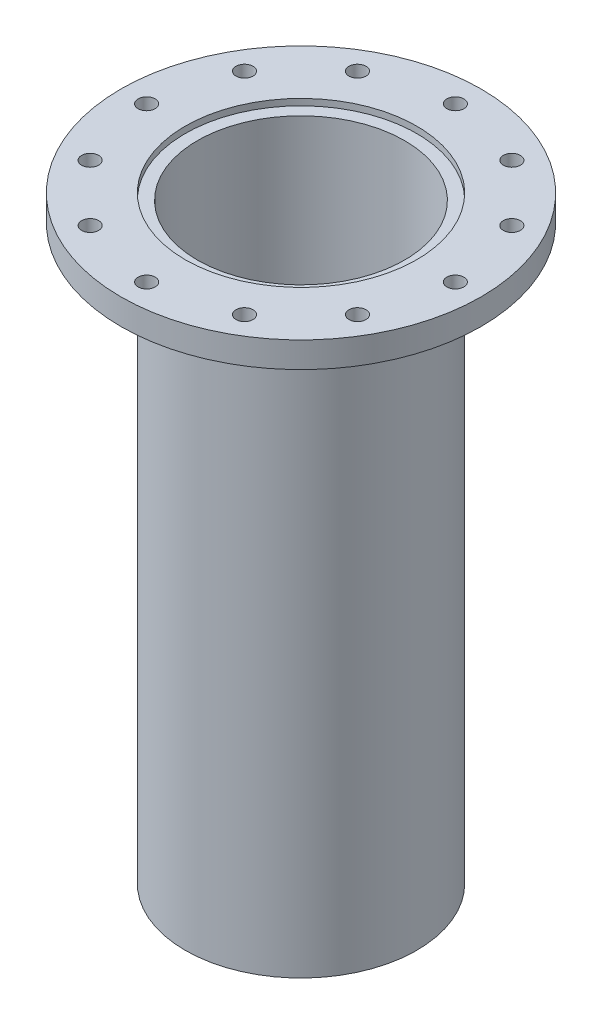
ISO-10303-21;
HEADER;
FILE_DESCRIPTION(('STEP AP214'),'2;1');
FILE_NAME('part.step','',(''),(''),'','','');
FILE_SCHEMA(('AUTOMOTIVE_DESIGN { 1 0 10303 214 1 1 1 1 }'));
ENDSEC;
DATA;
#1=APPLICATION_CONTEXT('core data for automotive mechanical design processes');
#2=APPLICATION_PROTOCOL_DEFINITION('international standard','automotive_design',2000,#1);
#3=PRODUCT_CONTEXT('',#1,'mechanical');
#4=PRODUCT('Part','Part','',(#3));
#5=PRODUCT_RELATED_PRODUCT_CATEGORY('part','',(#4));
#6=PRODUCT_DEFINITION_FORMATION('','',#4);
#7=PRODUCT_DEFINITION_CONTEXT('part definition',#1,'design');
#8=PRODUCT_DEFINITION('design','',#6,#7);
#9=PRODUCT_DEFINITION_SHAPE('','',#8);
#10=(LENGTH_UNIT() NAMED_UNIT(*) SI_UNIT(.MILLI.,.METRE.));
#11=(NAMED_UNIT(*) PLANE_ANGLE_UNIT() SI_UNIT($,.RADIAN.));
#12=(NAMED_UNIT(*) SI_UNIT($,.STERADIAN.) SOLID_ANGLE_UNIT());
#13=UNCERTAINTY_MEASURE_WITH_UNIT(LENGTH_MEASURE(1.E-05),#10,'distance_accuracy_value','');
#14=(GEOMETRIC_REPRESENTATION_CONTEXT(3) GLOBAL_UNCERTAINTY_ASSIGNED_CONTEXT((#13)) GLOBAL_UNIT_ASSIGNED_CONTEXT((#10,
#11,#12)) REPRESENTATION_CONTEXT('',''));
#15=CARTESIAN_POINT('',(0.,0.,0.));
#16=DIRECTION('',(0.,0.,1.));
#17=DIRECTION('',(1.,0.,0.));
#18=AXIS2_PLACEMENT_3D('',#15,#16,#17);
#19=CARTESIAN_POINT('',(0.,0.,0.));
#20=DIRECTION('',(0.,1.,0.));
#21=DIRECTION('',(0.,0.,1.));
#22=AXIS2_PLACEMENT_3D('',#19,#20,#21);
#23=CYLINDRICAL_SURFACE('',#22,57.15);
#24=CARTESIAN_POINT('',(0.,0.,0.));
#25=DIRECTION('',(0.,1.,0.));
#26=DIRECTION('',(0.,0.,1.));
#27=AXIS2_PLACEMENT_3D('',#24,#25,#26);
#28=CIRCLE('',#27,57.15);
#29=CARTESIAN_POINT('',(0.,0.,57.15));
#30=VERTEX_POINT('',#29);
#31=EDGE_CURVE('E10',#30,#30,#28,.T.);
#32=ORIENTED_EDGE('',*,*,#31,.T.);
#33=EDGE_LOOP('',(#32));
#34=FACE_BOUND('',#33,.T.);
#35=CARTESIAN_POINT('',(0.,-3.175,0.));
#36=DIRECTION('',(0.,1.,0.));
#37=DIRECTION('',(0.,0.,1.));
#38=AXIS2_PLACEMENT_3D('',#35,#36,#37);
#39=CIRCLE('',#38,57.15);
#40=CARTESIAN_POINT('',(0.,-3.175,57.15));
#41=VERTEX_POINT('',#40);
#42=EDGE_CURVE('E72',#41,#41,#39,.T.);
#43=ORIENTED_EDGE('',*,*,#42,.F.);
#44=EDGE_LOOP('',(#43));
#45=FACE_BOUND('',#44,.T.);
#46=ADVANCED_FACE('F37',(#34,#45),#23,.F.);
#47=CARTESIAN_POINT('',(-57.15,0.,0.));
#48=DIRECTION('',(0.,1.,0.));
#49=DIRECTION('',(0.,0.,1.));
#50=AXIS2_PLACEMENT_3D('',#47,#48,#49);
#51=PLANE('',#50);
#52=CARTESIAN_POINT('',(-38.0999999999999,0.,-65.9911357683743));
#53=DIRECTION('',(0.,1.,0.));
#54=DIRECTION('',(-0.86602540378444,0.,0.499999999999998));
#55=AXIS2_PLACEMENT_3D('',#52,#53,#54);
#56=CIRCLE('',#55,4.21639999999999);
#57=CARTESIAN_POINT('',(-41.7515095125166,0.,-63.8829357683743));
#58=VERTEX_POINT('',#57);
#59=EDGE_CURVE('E92',#58,#58,#56,.T.);
#60=ORIENTED_EDGE('',*,*,#59,.F.);
#61=EDGE_LOOP('',(#60));
#62=FACE_BOUND('',#61,.T.);
#63=CARTESIAN_POINT('',(2.66050878019847E-13,0.,-76.2));
#64=DIRECTION('',(0.,1.,0.));
#65=DIRECTION('',(-1.,0.,0.));
#66=AXIS2_PLACEMENT_3D('',#63,#64,#65);
#67=CIRCLE('',#66,4.21639999999999);
#68=CARTESIAN_POINT('',(-4.21639999999973,0.,-76.2));
#69=VERTEX_POINT('',#68);
#70=EDGE_CURVE('E143',#69,#69,#67,.T.);
#71=ORIENTED_EDGE('',*,*,#70,.F.);
#72=EDGE_LOOP('',(#71));
#73=FACE_BOUND('',#72,.T.);
#74=CARTESIAN_POINT('',(38.1000000000003,0.,-65.9911357683741));
#75=DIRECTION('',(0.,1.,0.));
#76=DIRECTION('',(-0.866025403784436,0.,-0.500000000000004));
#77=AXIS2_PLACEMENT_3D('',#74,#75,#76);
#78=CIRCLE('',#77,4.21639999999999);
#79=CARTESIAN_POINT('',(34.4484904874836,0.,-68.0993357683741));
#80=VERTEX_POINT('',#79);
#81=EDGE_CURVE('E135',#80,#80,#78,.T.);
#82=ORIENTED_EDGE('',*,*,#81,.F.);
#83=EDGE_LOOP('',(#82));
#84=FACE_BOUND('',#83,.T.);
#85=CARTESIAN_POINT('',(65.9911357683744,0.,-38.0999999999996));
#86=DIRECTION('',(0.,1.,0.));
#87=DIRECTION('',(-0.499999999999995,0.,-0.866025403784442));
#88=AXIS2_PLACEMENT_3D('',#85,#86,#87);
#89=CIRCLE('',#88,4.21639999999999);
#90=CARTESIAN_POINT('',(63.8829357683745,0.,-41.7515095125163));
#91=VERTEX_POINT('',#90);
#92=EDGE_CURVE('E127',#91,#91,#89,.T.);
#93=ORIENTED_EDGE('',*,*,#92,.F.);
#94=EDGE_LOOP('',(#93));
#95=FACE_BOUND('',#94,.T.);
#96=CARTESIAN_POINT('',(76.2,0.,0.));
#97=DIRECTION('',(0.,1.,0.));
#98=DIRECTION('',(0.,0.,-1.));
#99=AXIS2_PLACEMENT_3D('',#96,#97,#98);
#100=CIRCLE('',#99,4.21639999999999);
#101=CARTESIAN_POINT('',(76.2,0.,-4.21639999999999));
#102=VERTEX_POINT('',#101);
#103=EDGE_CURVE('E119',#102,#102,#100,.T.);
#104=ORIENTED_EDGE('',*,*,#103,.F.);
#105=EDGE_LOOP('',(#104));
#106=FACE_BOUND('',#105,.T.);
#107=CARTESIAN_POINT('',(65.9911357683739,0.,38.1000000000005));
#108=DIRECTION('',(0.,1.,0.));
#109=DIRECTION('',(0.500000000000007,0.,-0.866025403784435));
#110=AXIS2_PLACEMENT_3D('',#107,#108,#109);
#111=CIRCLE('',#110,4.21639999999999);
#112=CARTESIAN_POINT('',(68.099335768374,0.,34.4484904874839));
#113=VERTEX_POINT('',#112);
#114=EDGE_CURVE('E111',#113,#113,#111,.T.);
#115=ORIENTED_EDGE('',*,*,#114,.F.);
#116=EDGE_LOOP('',(#115));
#117=FACE_BOUND('',#116,.T.);
#118=CARTESIAN_POINT('',(38.0999999999994,0.,65.9911357683746));
#119=DIRECTION('',(0.,1.,0.));
#120=DIRECTION('',(0.866025403784443,0.,-0.499999999999992));
#121=AXIS2_PLACEMENT_3D('',#118,#119,#120);
#122=CIRCLE('',#121,4.21639999999999);
#123=CARTESIAN_POINT('',(41.7515095125161,0.,63.8829357683746));
#124=VERTEX_POINT('',#123);
#125=EDGE_CURVE('E103',#124,#124,#122,.T.);
#126=ORIENTED_EDGE('',*,*,#125,.F.);
#127=EDGE_LOOP('',(#126));
#128=FACE_BOUND('',#127,.T.);
#129=CARTESIAN_POINT('',(-7.9815263405954E-13,0.,76.2));
#130=DIRECTION('',(0.,1.,0.));
#131=DIRECTION('',(1.,0.,0.));
#132=AXIS2_PLACEMENT_3D('',#129,#130,#131);
#133=CIRCLE('',#132,4.21639999999999);
#134=CARTESIAN_POINT('',(4.2163999999992,0.,76.2));
#135=VERTEX_POINT('',#134);
#136=EDGE_CURVE('E93',#135,#135,#133,.T.);
#137=ORIENTED_EDGE('',*,*,#136,.F.);
#138=EDGE_LOOP('',(#137));
#139=FACE_BOUND('',#138,.T.);
#140=CARTESIAN_POINT('',(-38.1000000000008,0.,65.9911357683738));
#141=DIRECTION('',(0.,1.,0.));
#142=DIRECTION('',(0.866025403784433,0.,0.50000000000001));
#143=AXIS2_PLACEMENT_3D('',#140,#141,#142);
#144=CIRCLE('',#143,4.21639999999999);
#145=CARTESIAN_POINT('',(-34.4484904874841,0.,68.0993357683738));
#146=VERTEX_POINT('',#145);
#147=EDGE_CURVE('E102',#146,#146,#144,.T.);
#148=ORIENTED_EDGE('',*,*,#147,.F.);
#149=EDGE_LOOP('',(#148));
#150=FACE_BOUND('',#149,.T.);
#151=CARTESIAN_POINT('',(-65.9911357683747,0.,38.0999999999992));
#152=DIRECTION('',(0.,1.,0.));
#153=DIRECTION('',(0.499999999999989,0.,0.866025403784445));
#154=AXIS2_PLACEMENT_3D('',#151,#152,#153);
#155=CIRCLE('',#154,4.21639999999999);
#156=CARTESIAN_POINT('',(-63.8829357683748,0.,41.7515095125159));
#157=VERTEX_POINT('',#156);
#158=EDGE_CURVE('E157',#157,#157,#155,.T.);
#159=ORIENTED_EDGE('',*,*,#158,.F.);
#160=EDGE_LOOP('',(#159));
#161=FACE_BOUND('',#160,.T.);
#162=CARTESIAN_POINT('',(-65.9911357683742,0.,-38.1000000000001));
#163=DIRECTION('',(0.,1.,0.));
#164=DIRECTION('',(-0.500000000000001,0.,0.866025403784438));
#165=AXIS2_PLACEMENT_3D('',#162,#163,#164);
#166=CIRCLE('',#165,4.21639999999999);
#167=CARTESIAN_POINT('',(-68.0993357683742,0.,-34.4484904874834));
#168=VERTEX_POINT('',#167);
#169=EDGE_CURVE('E84',#168,#168,#166,.T.);
#170=ORIENTED_EDGE('',*,*,#169,.F.);
#171=EDGE_LOOP('',(#170));
#172=FACE_BOUND('',#171,.T.);
#173=CARTESIAN_POINT('',(-76.2,0.,0.));
#174=DIRECTION('',(0.,1.,0.));
#175=DIRECTION('',(0.,0.,1.));
#176=AXIS2_PLACEMENT_3D('',#173,#174,#175);
#177=CIRCLE('',#176,4.21639999999999);
#178=CARTESIAN_POINT('',(-76.2,0.,4.21639999999999));
#179=VERTEX_POINT('',#178);
#180=EDGE_CURVE('E80',#179,#179,#177,.T.);
#181=ORIENTED_EDGE('',*,*,#180,.F.);
#182=EDGE_LOOP('',(#181));
#183=FACE_BOUND('',#182,.T.);
#184=CARTESIAN_POINT('',(0.,0.,0.));
#185=DIRECTION('',(0.,1.,0.));
#186=DIRECTION('',(0.,0.,1.));
#187=AXIS2_PLACEMENT_3D('',#184,#185,#186);
#188=CIRCLE('',#187,88.9);
#189=CARTESIAN_POINT('',(0.,0.,88.9));
#190=VERTEX_POINT('',#189);
#191=EDGE_CURVE('E44',#190,#190,#188,.T.);
#192=ORIENTED_EDGE('',*,*,#191,.T.);
#193=EDGE_LOOP('',(#192));
#194=FACE_BOUND('',#193,.T.);
#195=ORIENTED_EDGE('',*,*,#31,.F.);
#196=EDGE_LOOP('',(#195));
#197=FACE_BOUND('',#196,.T.);
#198=ADVANCED_FACE('F195',(#62,#73,#84,#95,#106,#117,#128,#139,#150,#161,#172,#183,#194,#197),
#51,.T.);
#199=CARTESIAN_POINT('',(0.,0.,0.));
#200=DIRECTION('',(0.,1.,0.));
#201=DIRECTION('',(0.,0.,1.));
#202=AXIS2_PLACEMENT_3D('',#199,#200,#201);
#203=CYLINDRICAL_SURFACE('',#202,88.9);
#204=CARTESIAN_POINT('',(0.,-12.7,0.));
#205=DIRECTION('',(0.,1.,0.));
#206=DIRECTION('',(0.,0.,1.));
#207=AXIS2_PLACEMENT_3D('',#204,#205,#206);
#208=CIRCLE('',#207,88.9);
#209=CARTESIAN_POINT('',(0.,-12.7,88.9));
#210=VERTEX_POINT('',#209);
#211=EDGE_CURVE('E49',#210,#210,#208,.T.);
#212=ORIENTED_EDGE('',*,*,#211,.T.);
#213=EDGE_LOOP('',(#212));
#214=FACE_BOUND('',#213,.T.);
#215=ORIENTED_EDGE('',*,*,#191,.F.);
#216=EDGE_LOOP('',(#215));
#217=FACE_BOUND('',#216,.T.);
#218=ADVANCED_FACE('F180',(#214,#217),#203,.T.);
#219=CARTESIAN_POINT('',(-88.9,-12.7,0.));
#220=DIRECTION('',(0.,-1.,0.));
#221=DIRECTION('',(0.,0.,-1.));
#222=AXIS2_PLACEMENT_3D('',#219,#220,#221);
#223=PLANE('',#222);
#224=CARTESIAN_POINT('',(-38.0999999999999,-12.7,-65.9911357683743));
#225=DIRECTION('',(0.,-1.,0.));
#226=DIRECTION('',(0.86602540378444,0.,-0.499999999999998));
#227=AXIS2_PLACEMENT_3D('',#224,#225,#226);
#228=CIRCLE('',#227,4.21639999999996);
#229=CARTESIAN_POINT('',(-34.4484904874832,-12.7,-68.0993357683743));
#230=VERTEX_POINT('',#229);
#231=EDGE_CURVE('E147',#230,#230,#228,.T.);
#232=ORIENTED_EDGE('',*,*,#231,.F.);
#233=EDGE_LOOP('',(#232));
#234=FACE_BOUND('',#233,.T.);
#235=CARTESIAN_POINT('',(2.66050878019847E-13,-12.7,-76.2));
#236=DIRECTION('',(0.,-1.,0.));
#237=DIRECTION('',(1.,0.,0.));
#238=AXIS2_PLACEMENT_3D('',#235,#236,#237);
#239=CIRCLE('',#238,4.21639999999996);
#240=CARTESIAN_POINT('',(4.21640000000023,-12.7,-76.2));
#241=VERTEX_POINT('',#240);
#242=EDGE_CURVE('E139',#241,#241,#239,.T.);
#243=ORIENTED_EDGE('',*,*,#242,.F.);
#244=EDGE_LOOP('',(#243));
#245=FACE_BOUND('',#244,.T.);
#246=CARTESIAN_POINT('',(38.1000000000003,-12.7,-65.9911357683741));
#247=DIRECTION('',(0.,-1.,0.));
#248=DIRECTION('',(0.866025403784436,0.,0.500000000000004));
#249=AXIS2_PLACEMENT_3D('',#246,#247,#248);
#250=CIRCLE('',#249,4.21639999999996);
#251=CARTESIAN_POINT('',(41.751509512517,-12.7,-63.8829357683741));
#252=VERTEX_POINT('',#251);
#253=EDGE_CURVE('E131',#252,#252,#250,.T.);
#254=ORIENTED_EDGE('',*,*,#253,.F.);
#255=EDGE_LOOP('',(#254));
#256=FACE_BOUND('',#255,.T.);
#257=CARTESIAN_POINT('',(65.9911357683744,-12.7,-38.0999999999996));
#258=DIRECTION('',(0.,-1.,0.));
#259=DIRECTION('',(0.499999999999995,0.,0.866025403784442));
#260=AXIS2_PLACEMENT_3D('',#257,#258,#259);
#261=CIRCLE('',#260,4.21639999999996);
#262=CARTESIAN_POINT('',(68.0993357683744,-12.7,-34.4484904874829));
#263=VERTEX_POINT('',#262);
#264=EDGE_CURVE('E123',#263,#263,#261,.T.);
#265=ORIENTED_EDGE('',*,*,#264,.F.);
#266=EDGE_LOOP('',(#265));
#267=FACE_BOUND('',#266,.T.);
#268=CARTESIAN_POINT('',(76.2,-12.7,0.));
#269=DIRECTION('',(0.,-1.,0.));
#270=DIRECTION('',(0.,0.,1.));
#271=AXIS2_PLACEMENT_3D('',#268,#269,#270);
#272=CIRCLE('',#271,4.21639999999996);
#273=CARTESIAN_POINT('',(76.2,-12.7,4.21639999999996));
#274=VERTEX_POINT('',#273);
#275=EDGE_CURVE('E115',#274,#274,#272,.T.);
#276=ORIENTED_EDGE('',*,*,#275,.F.);
#277=EDGE_LOOP('',(#276));
#278=FACE_BOUND('',#277,.T.);
#279=CARTESIAN_POINT('',(65.9911357683739,-12.7,38.1000000000005));
#280=DIRECTION('',(0.,-1.,0.));
#281=DIRECTION('',(-0.500000000000007,0.,0.866025403784435));
#282=AXIS2_PLACEMENT_3D('',#279,#280,#281);
#283=CIRCLE('',#282,4.21639999999996);
#284=CARTESIAN_POINT('',(63.8829357683739,-12.7,41.7515095125172));
#285=VERTEX_POINT('',#284);
#286=EDGE_CURVE('E107',#285,#285,#283,.T.);
#287=ORIENTED_EDGE('',*,*,#286,.F.);
#288=EDGE_LOOP('',(#287));
#289=FACE_BOUND('',#288,.T.);
#290=CARTESIAN_POINT('',(38.0999999999994,-12.7,65.9911357683746));
#291=DIRECTION('',(0.,-1.,0.));
#292=DIRECTION('',(-0.866025403784443,0.,0.499999999999992));
#293=AXIS2_PLACEMENT_3D('',#290,#291,#292);
#294=CIRCLE('',#293,4.21639999999996);
#295=CARTESIAN_POINT('',(34.4484904874827,-12.7,68.0993357683745));
#296=VERTEX_POINT('',#295);
#297=EDGE_CURVE('E97',#296,#296,#294,.T.);
#298=ORIENTED_EDGE('',*,*,#297,.F.);
#299=EDGE_LOOP('',(#298));
#300=FACE_BOUND('',#299,.T.);
#301=CARTESIAN_POINT('',(-7.9815263405954E-13,-12.7,76.2));
#302=DIRECTION('',(0.,-1.,0.));
#303=DIRECTION('',(-1.,0.,0.));
#304=AXIS2_PLACEMENT_3D('',#301,#302,#303);
#305=CIRCLE('',#304,4.21639999999996);
#306=CARTESIAN_POINT('',(-4.21640000000076,-12.7,76.2));
#307=VERTEX_POINT('',#306);
#308=EDGE_CURVE('E98',#307,#307,#305,.T.);
#309=ORIENTED_EDGE('',*,*,#308,.F.);
#310=EDGE_LOOP('',(#309));
#311=FACE_BOUND('',#310,.T.);
#312=CARTESIAN_POINT('',(-38.1000000000008,-12.7,65.9911357683738));
#313=DIRECTION('',(0.,-1.,0.));
#314=DIRECTION('',(-0.866025403784433,0.,-0.50000000000001));
#315=AXIS2_PLACEMENT_3D('',#312,#313,#314);
#316=CIRCLE('',#315,4.21639999999996);
#317=CARTESIAN_POINT('',(-41.7515095125174,-12.7,63.8829357683738));
#318=VERTEX_POINT('',#317);
#319=EDGE_CURVE('E161',#318,#318,#316,.T.);
#320=ORIENTED_EDGE('',*,*,#319,.F.);
#321=EDGE_LOOP('',(#320));
#322=FACE_BOUND('',#321,.T.);
#323=CARTESIAN_POINT('',(-65.9911357683747,-12.7,38.0999999999992));
#324=DIRECTION('',(0.,-1.,0.));
#325=DIRECTION('',(-0.499999999999989,0.,-0.866025403784445));
#326=AXIS2_PLACEMENT_3D('',#323,#324,#325);
#327=CIRCLE('',#326,4.21639999999996);
#328=CARTESIAN_POINT('',(-68.0993357683747,-12.7,34.4484904874825));
#329=VERTEX_POINT('',#328);
#330=EDGE_CURVE('E162',#329,#329,#327,.T.);
#331=ORIENTED_EDGE('',*,*,#330,.F.);
#332=EDGE_LOOP('',(#331));
#333=FACE_BOUND('',#332,.T.);
#334=CARTESIAN_POINT('',(-65.9911357683742,-12.7,-38.1000000000001));
#335=DIRECTION('',(0.,-1.,0.));
#336=DIRECTION('',(0.500000000000001,0.,-0.866025403784438));
#337=AXIS2_PLACEMENT_3D('',#334,#335,#336);
#338=CIRCLE('',#337,4.21639999999996);
#339=CARTESIAN_POINT('',(-63.8829357683742,-12.7,-41.7515095125167));
#340=VERTEX_POINT('',#339);
#341=EDGE_CURVE('E88',#340,#340,#338,.T.);
#342=ORIENTED_EDGE('',*,*,#341,.F.);
#343=EDGE_LOOP('',(#342));
#344=FACE_BOUND('',#343,.T.);
#345=CARTESIAN_POINT('',(-76.2,-12.7,0.));
#346=DIRECTION('',(0.,-1.,0.));
#347=DIRECTION('',(0.,0.,-1.));
#348=AXIS2_PLACEMENT_3D('',#345,#346,#347);
#349=CIRCLE('',#348,4.21639999999996);
#350=CARTESIAN_POINT('',(-76.2,-12.7,-4.21639999999996));
#351=VERTEX_POINT('',#350);
#352=EDGE_CURVE('E76',#351,#351,#349,.T.);
#353=ORIENTED_EDGE('',*,*,#352,.F.);
#354=EDGE_LOOP('',(#353));
#355=FACE_BOUND('',#354,.T.);
#356=CARTESIAN_POINT('',(0.,-12.7,0.));
#357=DIRECTION('',(0.,1.,0.));
#358=DIRECTION('',(0.,0.,1.));
#359=AXIS2_PLACEMENT_3D('',#356,#357,#358);
#360=CIRCLE('',#359,57.15);
#361=CARTESIAN_POINT('',(0.,-12.7,57.15));
#362=VERTEX_POINT('',#361);
#363=EDGE_CURVE('E54',#362,#362,#360,.T.);
#364=ORIENTED_EDGE('',*,*,#363,.T.);
#365=EDGE_LOOP('',(#364));
#366=FACE_BOUND('',#365,.T.);
#367=ORIENTED_EDGE('',*,*,#211,.F.);
#368=EDGE_LOOP('',(#367));
#369=FACE_BOUND('',#368,.T.);
#370=ADVANCED_FACE('F176',(#234,#245,#256,#267,#278,#289,#300,#311,#322,#333,#344,#355,#366,
#369),#223,.T.);
#371=CARTESIAN_POINT('',(0.,0.,0.));
#372=DIRECTION('',(0.,1.,0.));
#373=DIRECTION('',(0.,0.,1.));
#374=AXIS2_PLACEMENT_3D('',#371,#372,#373);
#375=CYLINDRICAL_SURFACE('',#374,57.15);
#376=CARTESIAN_POINT('',(0.,-295.275,0.));
#377=DIRECTION('',(0.,1.,0.));
#378=DIRECTION('',(0.,0.,1.));
#379=AXIS2_PLACEMENT_3D('',#376,#377,#378);
#380=CIRCLE('',#379,57.15);
#381=CARTESIAN_POINT('',(0.,-295.275,57.15));
#382=VERTEX_POINT('',#381);
#383=EDGE_CURVE('E60',#382,#382,#380,.T.);
#384=ORIENTED_EDGE('',*,*,#383,.T.);
#385=EDGE_LOOP('',(#384));
#386=FACE_BOUND('',#385,.T.);
#387=ORIENTED_EDGE('',*,*,#363,.F.);
#388=EDGE_LOOP('',(#387));
#389=FACE_BOUND('',#388,.T.);
#390=ADVANCED_FACE('F179',(#386,#389),#375,.T.);
#391=CARTESIAN_POINT('',(-57.15,-295.275,0.));
#392=DIRECTION('',(0.,-1.,0.));
#393=DIRECTION('',(0.,0.,-1.));
#394=AXIS2_PLACEMENT_3D('',#391,#392,#393);
#395=PLANE('',#394);
#396=CARTESIAN_POINT('',(0.,-295.275,0.));
#397=DIRECTION('',(0.,1.,0.));
#398=DIRECTION('',(0.,0.,1.));
#399=AXIS2_PLACEMENT_3D('',#396,#397,#398);
#400=CIRCLE('',#399,51.1302);
#401=CARTESIAN_POINT('',(0.,-295.275,51.1302));
#402=VERTEX_POINT('',#401);
#403=EDGE_CURVE('E64',#402,#402,#400,.T.);
#404=ORIENTED_EDGE('',*,*,#403,.T.);
#405=EDGE_LOOP('',(#404));
#406=FACE_BOUND('',#405,.T.);
#407=ORIENTED_EDGE('',*,*,#383,.F.);
#408=EDGE_LOOP('',(#407));
#409=FACE_BOUND('',#408,.T.);
#410=ADVANCED_FACE('F217',(#406,#409),#395,.T.);
#411=CARTESIAN_POINT('',(0.,0.,0.));
#412=DIRECTION('',(0.,1.,0.));
#413=DIRECTION('',(0.,0.,1.));
#414=AXIS2_PLACEMENT_3D('',#411,#412,#413);
#415=CYLINDRICAL_SURFACE('',#414,51.1302);
#416=CARTESIAN_POINT('',(0.,-3.175,0.));
#417=DIRECTION('',(0.,1.,0.));
#418=DIRECTION('',(0.,0.,1.));
#419=AXIS2_PLACEMENT_3D('',#416,#417,#418);
#420=CIRCLE('',#419,51.1302);
#421=CARTESIAN_POINT('',(0.,-3.175,51.1302));
#422=VERTEX_POINT('',#421);
#423=EDGE_CURVE('E68',#422,#422,#420,.T.);
#424=ORIENTED_EDGE('',*,*,#423,.T.);
#425=EDGE_LOOP('',(#424));
#426=FACE_BOUND('',#425,.T.);
#427=ORIENTED_EDGE('',*,*,#403,.F.);
#428=EDGE_LOOP('',(#427));
#429=FACE_BOUND('',#428,.T.);
#430=ADVANCED_FACE('F211',(#426,#429),#415,.F.);
#431=CARTESIAN_POINT('',(-51.1302,-3.175,0.));
#432=DIRECTION('',(0.,1.,0.));
#433=DIRECTION('',(0.,0.,1.));
#434=AXIS2_PLACEMENT_3D('',#431,#432,#433);
#435=PLANE('',#434);
#436=ORIENTED_EDGE('',*,*,#42,.T.);
#437=EDGE_LOOP('',(#436));
#438=FACE_BOUND('',#437,.T.);
#439=ORIENTED_EDGE('',*,*,#423,.F.);
#440=EDGE_LOOP('',(#439));
#441=FACE_BOUND('',#440,.T.);
#442=ADVANCED_FACE('F207',(#438,#441),#435,.T.);
#443=CARTESIAN_POINT('',(-76.2,0.,0.));
#444=DIRECTION('',(0.,1.,0.));
#445=DIRECTION('',(0.,0.,1.));
#446=AXIS2_PLACEMENT_3D('',#443,#444,#445);
#447=CYLINDRICAL_SURFACE('',#446,4.21639999999996);
#448=ORIENTED_EDGE('',*,*,#352,.T.);
#449=EDGE_LOOP('',(#448));
#450=FACE_BOUND('',#449,.T.);
#451=ORIENTED_EDGE('',*,*,#180,.T.);
#452=EDGE_LOOP('',(#451));
#453=FACE_BOUND('',#452,.T.);
#454=ADVANCED_FACE('F210',(#450,#453),#447,.F.);
#455=CARTESIAN_POINT('',(-65.9911357683742,0.,-38.1000000000001));
#456=DIRECTION('',(0.,1.,0.));
#457=DIRECTION('',(-0.500000000000001,0.,0.866025403784438));
#458=AXIS2_PLACEMENT_3D('',#455,#456,#457);
#459=CYLINDRICAL_SURFACE('',#458,4.21639999999996);
#460=ORIENTED_EDGE('',*,*,#341,.T.);
#461=EDGE_LOOP('',(#460));
#462=FACE_BOUND('',#461,.T.);
#463=ORIENTED_EDGE('',*,*,#169,.T.);
#464=EDGE_LOOP('',(#463));
#465=FACE_BOUND('',#464,.T.);
#466=ADVANCED_FACE('F234',(#462,#465),#459,.F.);
#467=CARTESIAN_POINT('',(-65.9911357683747,0.,38.0999999999992));
#468=DIRECTION('',(0.,1.,0.));
#469=DIRECTION('',(0.499999999999989,0.,0.866025403784445));
#470=AXIS2_PLACEMENT_3D('',#467,#468,#469);
#471=CYLINDRICAL_SURFACE('',#470,4.21639999999996);
#472=ORIENTED_EDGE('',*,*,#330,.T.);
#473=EDGE_LOOP('',(#472));
#474=FACE_BOUND('',#473,.T.);
#475=ORIENTED_EDGE('',*,*,#158,.T.);
#476=EDGE_LOOP('',(#475));
#477=FACE_BOUND('',#476,.T.);
#478=ADVANCED_FACE('F238',(#474,#477),#471,.F.);
#479=CARTESIAN_POINT('',(-38.1000000000008,0.,65.9911357683738));
#480=DIRECTION('',(0.,1.,0.));
#481=DIRECTION('',(0.866025403784433,0.,0.50000000000001));
#482=AXIS2_PLACEMENT_3D('',#479,#480,#481);
#483=CYLINDRICAL_SURFACE('',#482,4.21639999999996);
#484=ORIENTED_EDGE('',*,*,#319,.T.);
#485=EDGE_LOOP('',(#484));
#486=FACE_BOUND('',#485,.T.);
#487=ORIENTED_EDGE('',*,*,#147,.T.);
#488=EDGE_LOOP('',(#487));
#489=FACE_BOUND('',#488,.T.);
#490=ADVANCED_FACE('F173',(#486,#489),#483,.F.);
#491=CARTESIAN_POINT('',(-7.9815263405954E-13,0.,76.2));
#492=DIRECTION('',(0.,1.,0.));
#493=DIRECTION('',(1.,0.,0.));
#494=AXIS2_PLACEMENT_3D('',#491,#492,#493);
#495=CYLINDRICAL_SURFACE('',#494,4.21639999999996);
#496=ORIENTED_EDGE('',*,*,#308,.T.);
#497=EDGE_LOOP('',(#496));
#498=FACE_BOUND('',#497,.T.);
#499=ORIENTED_EDGE('',*,*,#136,.T.);
#500=EDGE_LOOP('',(#499));
#501=FACE_BOUND('',#500,.T.);
#502=ADVANCED_FACE('F240',(#498,#501),#495,.F.);
#503=CARTESIAN_POINT('',(38.0999999999994,0.,65.9911357683746));
#504=DIRECTION('',(0.,1.,0.));
#505=DIRECTION('',(0.866025403784443,0.,-0.499999999999992));
#506=AXIS2_PLACEMENT_3D('',#503,#504,#505);
#507=CYLINDRICAL_SURFACE('',#506,4.21639999999996);
#508=ORIENTED_EDGE('',*,*,#297,.T.);
#509=EDGE_LOOP('',(#508));
#510=FACE_BOUND('',#509,.T.);
#511=ORIENTED_EDGE('',*,*,#125,.T.);
#512=EDGE_LOOP('',(#511));
#513=FACE_BOUND('',#512,.T.);
#514=ADVANCED_FACE('F243',(#510,#513),#507,.F.);
#515=CARTESIAN_POINT('',(65.9911357683739,0.,38.1000000000005));
#516=DIRECTION('',(0.,1.,0.));
#517=DIRECTION('',(0.500000000000007,0.,-0.866025403784435));
#518=AXIS2_PLACEMENT_3D('',#515,#516,#517);
#519=CYLINDRICAL_SURFACE('',#518,4.21639999999996);
#520=ORIENTED_EDGE('',*,*,#286,.T.);
#521=EDGE_LOOP('',(#520));
#522=FACE_BOUND('',#521,.T.);
#523=ORIENTED_EDGE('',*,*,#114,.T.);
#524=EDGE_LOOP('',(#523));
#525=FACE_BOUND('',#524,.T.);
#526=ADVANCED_FACE('F247',(#522,#525),#519,.F.);
#527=CARTESIAN_POINT('',(76.2,0.,0.));
#528=DIRECTION('',(0.,1.,0.));
#529=DIRECTION('',(0.,0.,-1.));
#530=AXIS2_PLACEMENT_3D('',#527,#528,#529);
#531=CYLINDRICAL_SURFACE('',#530,4.21639999999996);
#532=ORIENTED_EDGE('',*,*,#275,.T.);
#533=EDGE_LOOP('',(#532));
#534=FACE_BOUND('',#533,.T.);
#535=ORIENTED_EDGE('',*,*,#103,.T.);
#536=EDGE_LOOP('',(#535));
#537=FACE_BOUND('',#536,.T.);
#538=ADVANCED_FACE('F251',(#534,#537),#531,.F.);
#539=CARTESIAN_POINT('',(65.9911357683744,0.,-38.0999999999996));
#540=DIRECTION('',(0.,1.,0.));
#541=DIRECTION('',(-0.499999999999995,0.,-0.866025403784442));
#542=AXIS2_PLACEMENT_3D('',#539,#540,#541);
#543=CYLINDRICAL_SURFACE('',#542,4.21639999999996);
#544=ORIENTED_EDGE('',*,*,#264,.T.);
#545=EDGE_LOOP('',(#544));
#546=FACE_BOUND('',#545,.T.);
#547=ORIENTED_EDGE('',*,*,#92,.T.);
#548=EDGE_LOOP('',(#547));
#549=FACE_BOUND('',#548,.T.);
#550=ADVANCED_FACE('F255',(#546,#549),#543,.F.);
#551=CARTESIAN_POINT('',(38.1000000000003,0.,-65.9911357683741));
#552=DIRECTION('',(0.,1.,0.));
#553=DIRECTION('',(-0.866025403784436,0.,-0.500000000000004));
#554=AXIS2_PLACEMENT_3D('',#551,#552,#553);
#555=CYLINDRICAL_SURFACE('',#554,4.21639999999996);
#556=ORIENTED_EDGE('',*,*,#253,.T.);
#557=EDGE_LOOP('',(#556));
#558=FACE_BOUND('',#557,.T.);
#559=ORIENTED_EDGE('',*,*,#81,.T.);
#560=EDGE_LOOP('',(#559));
#561=FACE_BOUND('',#560,.T.);
#562=ADVANCED_FACE('F259',(#558,#561),#555,.F.);
#563=CARTESIAN_POINT('',(2.66050878019847E-13,0.,-76.2));
#564=DIRECTION('',(0.,1.,0.));
#565=DIRECTION('',(-1.,0.,0.));
#566=AXIS2_PLACEMENT_3D('',#563,#564,#565);
#567=CYLINDRICAL_SURFACE('',#566,4.21639999999996);
#568=ORIENTED_EDGE('',*,*,#242,.T.);
#569=EDGE_LOOP('',(#568));
#570=FACE_BOUND('',#569,.T.);
#571=ORIENTED_EDGE('',*,*,#70,.T.);
#572=EDGE_LOOP('',(#571));
#573=FACE_BOUND('',#572,.T.);
#574=ADVANCED_FACE('F263',(#570,#573),#567,.F.);
#575=CARTESIAN_POINT('',(-38.0999999999999,0.,-65.9911357683743));
#576=DIRECTION('',(0.,1.,0.));
#577=DIRECTION('',(-0.86602540378444,0.,0.499999999999998));
#578=AXIS2_PLACEMENT_3D('',#575,#576,#577);
#579=CYLINDRICAL_SURFACE('',#578,4.21639999999996);
#580=ORIENTED_EDGE('',*,*,#231,.T.);
#581=EDGE_LOOP('',(#580));
#582=FACE_BOUND('',#581,.T.);
#583=ORIENTED_EDGE('',*,*,#59,.T.);
#584=EDGE_LOOP('',(#583));
#585=FACE_BOUND('',#584,.T.);
#586=ADVANCED_FACE('F267',(#582,#585),#579,.F.);
#587=CLOSED_SHELL('',(#46,#198,#218,#370,#390,#410,#430,#442,#454,#466,#478,#490,#502,#514,#526,
#538,#550,#562,#574,#586));
#588=MANIFOLD_SOLID_BREP('B2',#587);
#589=ADVANCED_BREP_SHAPE_REPRESENTATION('',(#18,#588),#14);
#590=SHAPE_DEFINITION_REPRESENTATION(#9,#589);
ENDSEC;
END-ISO-10303-21;
